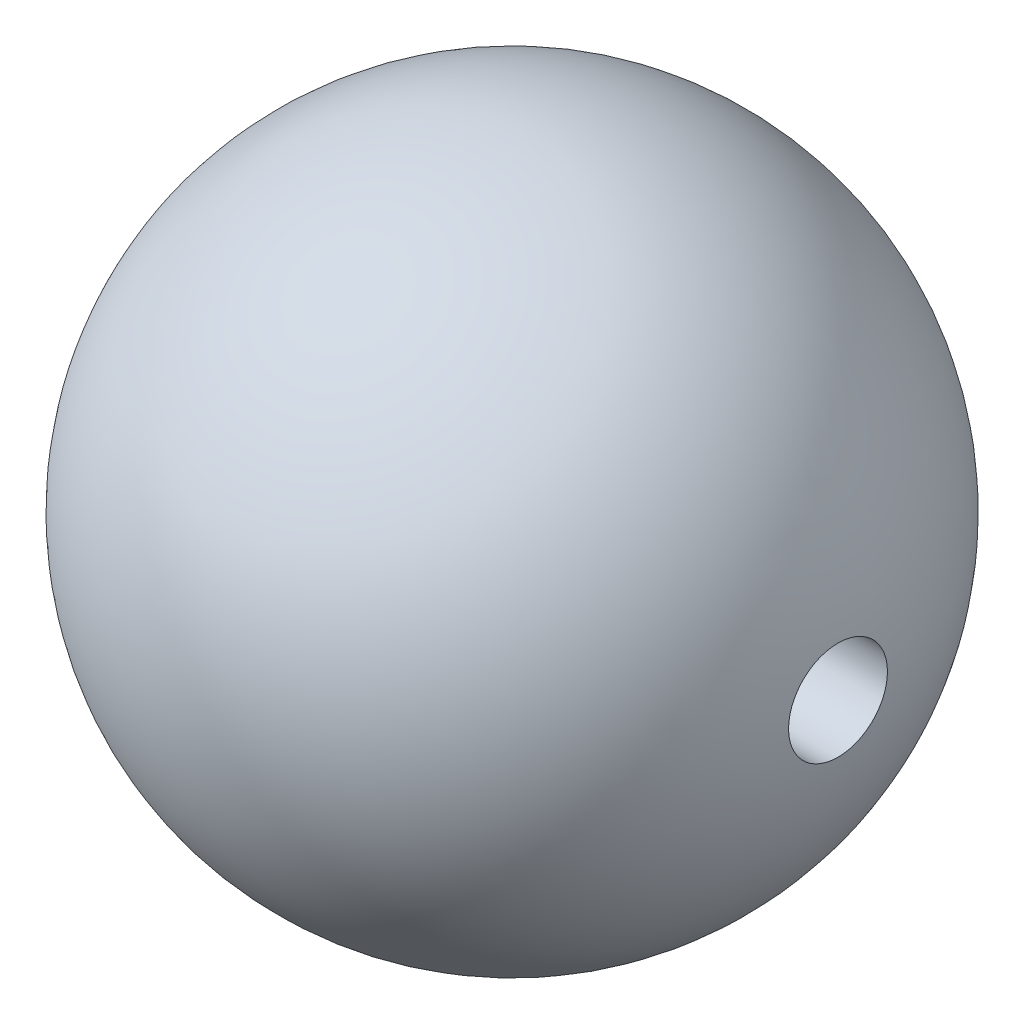
ISO-10303-21;
HEADER;
FILE_DESCRIPTION(('STEP AP214'),'2;1');
FILE_NAME('part.step','',(''),(''),'','','');
FILE_SCHEMA(('AUTOMOTIVE_DESIGN { 1 0 10303 214 1 1 1 1 }'));
ENDSEC;
DATA;
#1=APPLICATION_CONTEXT('core data for automotive mechanical design processes');
#2=APPLICATION_PROTOCOL_DEFINITION('international standard','automotive_design',2000,#1);
#3=PRODUCT_CONTEXT('',#1,'mechanical');
#4=PRODUCT('Part','Part','',(#3));
#5=PRODUCT_RELATED_PRODUCT_CATEGORY('part','',(#4));
#6=PRODUCT_DEFINITION_FORMATION('','',#4);
#7=PRODUCT_DEFINITION_CONTEXT('part definition',#1,'design');
#8=PRODUCT_DEFINITION('design','',#6,#7);
#9=PRODUCT_DEFINITION_SHAPE('','',#8);
#10=(LENGTH_UNIT() NAMED_UNIT(*) SI_UNIT(.MILLI.,.METRE.));
#11=(NAMED_UNIT(*) PLANE_ANGLE_UNIT() SI_UNIT($,.RADIAN.));
#12=(NAMED_UNIT(*) SI_UNIT($,.STERADIAN.) SOLID_ANGLE_UNIT());
#13=UNCERTAINTY_MEASURE_WITH_UNIT(LENGTH_MEASURE(1.E-05),#10,'distance_accuracy_value','');
#14=(GEOMETRIC_REPRESENTATION_CONTEXT(3) GLOBAL_UNCERTAINTY_ASSIGNED_CONTEXT((#13)) GLOBAL_UNIT_ASSIGNED_CONTEXT((#10,
#11,#12)) REPRESENTATION_CONTEXT('',''));
#15=CARTESIAN_POINT('',(0.,0.,0.));
#16=DIRECTION('',(0.,0.,1.));
#17=DIRECTION('',(1.,0.,0.));
#18=AXIS2_PLACEMENT_3D('',#15,#16,#17);
#19=CARTESIAN_POINT('',(0.,0.,0.));
#20=DIRECTION('',(-1.,0.,0.));
#21=DIRECTION('',(0.,0.,-1.));
#22=AXIS2_PLACEMENT_3D('',#19,#20,#21);
#23=SPHERICAL_SURFACE('',#22,10.);
#24=CARTESIAN_POINT('',(9.88685996664259,0.,0.));
#25=DIRECTION('',(-1.,0.,0.));
#26=DIRECTION('',(0.,0.,1.));
#27=AXIS2_PLACEMENT_3D('',#24,#25,#26);
#28=CIRCLE('',#27,1.5);
#29=CARTESIAN_POINT('',(9.88685996664259,0.,1.5));
#30=VERTEX_POINT('',#29);
#31=EDGE_CURVE('E10',#30,#30,#28,.F.);
#32=ORIENTED_EDGE('',*,*,#31,.F.);
#33=EDGE_LOOP('',(#32));
#34=FACE_BOUND('',#33,.T.);
#35=ADVANCED_FACE('F34',(#34),#23,.T.);
#36=CARTESIAN_POINT('',(10.,0.,0.));
#37=DIRECTION('',(-1.,0.,0.));
#38=DIRECTION('',(0.,0.,1.));
#39=AXIS2_PLACEMENT_3D('',#36,#37,#38);
#40=CYLINDRICAL_SURFACE('',#39,1.5);
#41=CARTESIAN_POINT('',(0.,0.,0.));
#42=DIRECTION('',(1.,0.,0.));
#43=DIRECTION('',(0.,0.,-1.));
#44=AXIS2_PLACEMENT_3D('',#41,#42,#43);
#45=CIRCLE('',#44,1.5);
#46=CARTESIAN_POINT('',(0.,0.,-1.5));
#47=VERTEX_POINT('',#46);
#48=EDGE_CURVE('E40',#47,#47,#45,.T.);
#49=ORIENTED_EDGE('',*,*,#48,.F.);
#50=EDGE_LOOP('',(#49));
#51=FACE_BOUND('',#50,.T.);
#52=ORIENTED_EDGE('',*,*,#31,.T.);
#53=EDGE_LOOP('',(#52));
#54=FACE_BOUND('',#53,.T.);
#55=ADVANCED_FACE('F48',(#51,#54),#40,.F.);
#56=CARTESIAN_POINT('',(0.,0.,0.));
#57=DIRECTION('',(1.,0.,0.));
#58=DIRECTION('',(0.,0.,-1.));
#59=AXIS2_PLACEMENT_3D('',#56,#57,#58);
#60=PLANE('',#59);
#61=ORIENTED_EDGE('',*,*,#48,.T.);
#62=EDGE_LOOP('',(#61));
#63=FACE_BOUND('',#62,.T.);
#64=ADVANCED_FACE('F46',(#63),#60,.T.);
#65=CLOSED_SHELL('',(#35,#55,#64));
#66=MANIFOLD_SOLID_BREP('B2',#65);
#67=ADVANCED_BREP_SHAPE_REPRESENTATION('',(#18,#66),#14);
#68=SHAPE_DEFINITION_REPRESENTATION(#9,#67);
ENDSEC;
END-ISO-10303-21;
